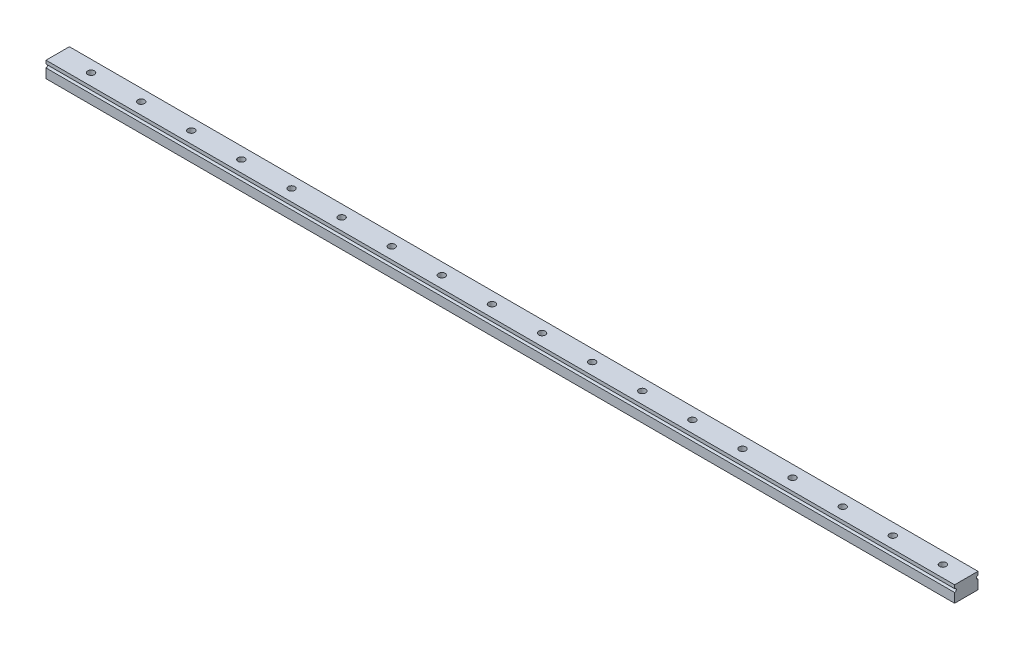
ISO-10303-21;
HEADER;
FILE_DESCRIPTION(('STEP AP214'),'2;1');
FILE_NAME('part.step','',(''),(''),'','','');
FILE_SCHEMA(('AUTOMOTIVE_DESIGN { 1 0 10303 214 1 1 1 1 }'));
ENDSEC;
DATA;
#1=APPLICATION_CONTEXT('core data for automotive mechanical design processes');
#2=APPLICATION_PROTOCOL_DEFINITION('international standard','automotive_design',2000,#1);
#3=PRODUCT_CONTEXT('',#1,'mechanical');
#4=PRODUCT('Part','Part','',(#3));
#5=PRODUCT_RELATED_PRODUCT_CATEGORY('part','',(#4));
#6=PRODUCT_DEFINITION_FORMATION('','',#4);
#7=PRODUCT_DEFINITION_CONTEXT('part definition',#1,'design');
#8=PRODUCT_DEFINITION('design','',#6,#7);
#9=PRODUCT_DEFINITION_SHAPE('','',#8);
#10=(LENGTH_UNIT() NAMED_UNIT(*) SI_UNIT(.MILLI.,.METRE.));
#11=(NAMED_UNIT(*) PLANE_ANGLE_UNIT() SI_UNIT($,.RADIAN.));
#12=(NAMED_UNIT(*) SI_UNIT($,.STERADIAN.) SOLID_ANGLE_UNIT());
#13=UNCERTAINTY_MEASURE_WITH_UNIT(LENGTH_MEASURE(1.E-05),#10,'distance_accuracy_value','');
#14=(GEOMETRIC_REPRESENTATION_CONTEXT(3) GLOBAL_UNCERTAINTY_ASSIGNED_CONTEXT((#13)) GLOBAL_UNIT_ASSIGNED_CONTEXT((#10,
#11,#12)) REPRESENTATION_CONTEXT('',''));
#15=CARTESIAN_POINT('',(0.,0.,0.));
#16=DIRECTION('',(0.,0.,1.));
#17=DIRECTION('',(1.,0.,0.));
#18=AXIS2_PLACEMENT_3D('',#15,#16,#17);
#19=CARTESIAN_POINT('',(272.,0.9,-3.5));
#20=DIRECTION('',(-1.,0.,0.));
#21=DIRECTION('',(0.,0.,1.));
#22=AXIS2_PLACEMENT_3D('',#19,#20,#21);
#23=CYLINDRICAL_SURFACE('',#22,0.500000000000001);
#24=CARTESIAN_POINT('',(0.,0.9,-3.5));
#25=DIRECTION('',(1.,0.,0.));
#26=DIRECTION('',(0.,0.,-1.));
#27=AXIS2_PLACEMENT_3D('',#24,#25,#26);
#28=CIRCLE('',#27,0.500000000000001);
#29=CARTESIAN_POINT('',(0.,1.4,-3.5));
#30=VERTEX_POINT('',#29);
#31=CARTESIAN_POINT('',(0.,0.399999999999999,-3.5));
#32=VERTEX_POINT('',#31);
#33=EDGE_CURVE('E135',#30,#32,#28,.T.);
#34=ORIENTED_EDGE('',*,*,#33,.F.);
#35=DIRECTION('',(-1.,0.,0.));
#36=VECTOR('',#35,1.);
#37=CARTESIAN_POINT('',(272.,1.4,-3.5));
#38=LINE('',#37,#36);
#39=CARTESIAN_POINT('',(272.,1.4,-3.5));
#40=VERTEX_POINT('',#39);
#41=EDGE_CURVE('E11',#40,#30,#38,.T.);
#42=ORIENTED_EDGE('',*,*,#41,.F.);
#43=CARTESIAN_POINT('',(272.,0.9,-3.5));
#44=DIRECTION('',(1.,0.,0.));
#45=DIRECTION('',(0.,0.,-1.));
#46=AXIS2_PLACEMENT_3D('',#43,#44,#45);
#47=CIRCLE('',#46,0.500000000000001);
#48=CARTESIAN_POINT('',(272.,0.399999999999999,-3.5));
#49=VERTEX_POINT('',#48);
#50=EDGE_CURVE('E179',#40,#49,#47,.T.);
#51=ORIENTED_EDGE('',*,*,#50,.T.);
#52=DIRECTION('',(-1.,0.,0.));
#53=VECTOR('',#52,1.);
#54=CARTESIAN_POINT('',(272.,0.399999999999999,-3.5));
#55=LINE('',#54,#53);
#56=EDGE_CURVE('E57',#49,#32,#55,.T.);
#57=ORIENTED_EDGE('',*,*,#56,.T.);
#58=EDGE_LOOP('',(#34,#42,#51,#57));
#59=FACE_BOUND('',#58,.T.);
#60=ADVANCED_FACE('F41',(#59),#23,.F.);
#61=CARTESIAN_POINT('',(272.,0.,-3.5));
#62=DIRECTION('',(0.,0.,-1.));
#63=DIRECTION('',(0.,1.,0.));
#64=AXIS2_PLACEMENT_3D('',#61,#62,#63);
#65=PLANE('',#64);
#66=DIRECTION('',(0.,-1.,0.));
#67=VECTOR('',#66,1.);
#68=CARTESIAN_POINT('',(0.,0.,-3.5));
#69=LINE('',#68,#67);
#70=CARTESIAN_POINT('',(0.,2.4,-3.5));
#71=VERTEX_POINT('',#70);
#72=EDGE_CURVE('E137',#71,#30,#69,.T.);
#73=ORIENTED_EDGE('',*,*,#72,.F.);
#74=DIRECTION('',(-1.,0.,0.));
#75=VECTOR('',#74,1.);
#76=CARTESIAN_POINT('',(272.,2.4,-3.5));
#77=LINE('',#76,#75);
#78=CARTESIAN_POINT('',(272.,2.4,-3.5));
#79=VERTEX_POINT('',#78);
#80=EDGE_CURVE('E49',#79,#71,#77,.T.);
#81=ORIENTED_EDGE('',*,*,#80,.F.);
#82=DIRECTION('',(0.,-1.,0.));
#83=VECTOR('',#82,1.);
#84=CARTESIAN_POINT('',(272.,0.,-3.5));
#85=LINE('',#84,#83);
#86=EDGE_CURVE('E132',#79,#40,#85,.T.);
#87=ORIENTED_EDGE('',*,*,#86,.T.);
#88=ORIENTED_EDGE('',*,*,#41,.T.);
#89=EDGE_LOOP('',(#73,#81,#87,#88));
#90=FACE_BOUND('',#89,.T.);
#91=ADVANCED_FACE('F169',(#90),#65,.T.);
#92=CARTESIAN_POINT('',(272.,2.4,0.));
#93=DIRECTION('',(0.,1.,0.));
#94=DIRECTION('',(0.,0.,1.));
#95=AXIS2_PLACEMENT_3D('',#92,#93,#94);
#96=PLANE('',#95);
#97=CARTESIAN_POINT('',(265.,2.4,0.));
#98=DIRECTION('',(0.,1.,0.));
#99=DIRECTION('',(0.,0.,1.));
#100=AXIS2_PLACEMENT_3D('',#97,#98,#99);
#101=CIRCLE('',#100,0.999999999999998);
#102=CARTESIAN_POINT('',(265.,2.4,0.999999999999998));
#103=VERTEX_POINT('',#102);
#104=EDGE_CURVE('E284',#103,#103,#101,.T.);
#105=ORIENTED_EDGE('',*,*,#104,.F.);
#106=EDGE_LOOP('',(#105));
#107=FACE_BOUND('',#106,.T.);
#108=CARTESIAN_POINT('',(250.,2.4,0.));
#109=DIRECTION('',(0.,1.,0.));
#110=DIRECTION('',(0.,0.,1.));
#111=AXIS2_PLACEMENT_3D('',#108,#109,#110);
#112=CIRCLE('',#111,0.999999999999998);
#113=CARTESIAN_POINT('',(250.,2.4,0.999999999999998));
#114=VERTEX_POINT('',#113);
#115=EDGE_CURVE('E278',#114,#114,#112,.T.);
#116=ORIENTED_EDGE('',*,*,#115,.F.);
#117=EDGE_LOOP('',(#116));
#118=FACE_BOUND('',#117,.T.);
#119=CARTESIAN_POINT('',(235.,2.4,0.));
#120=DIRECTION('',(0.,1.,0.));
#121=DIRECTION('',(0.,0.,1.));
#122=AXIS2_PLACEMENT_3D('',#119,#120,#121);
#123=CIRCLE('',#122,0.999999999999998);
#124=CARTESIAN_POINT('',(235.,2.4,0.999999999999998));
#125=VERTEX_POINT('',#124);
#126=EDGE_CURVE('E272',#125,#125,#123,.T.);
#127=ORIENTED_EDGE('',*,*,#126,.F.);
#128=EDGE_LOOP('',(#127));
#129=FACE_BOUND('',#128,.T.);
#130=CARTESIAN_POINT('',(220.,2.4,0.));
#131=DIRECTION('',(0.,1.,0.));
#132=DIRECTION('',(0.,0.,1.));
#133=AXIS2_PLACEMENT_3D('',#130,#131,#132);
#134=CIRCLE('',#133,0.999999999999998);
#135=CARTESIAN_POINT('',(220.,2.4,0.999999999999998));
#136=VERTEX_POINT('',#135);
#137=EDGE_CURVE('E266',#136,#136,#134,.T.);
#138=ORIENTED_EDGE('',*,*,#137,.F.);
#139=EDGE_LOOP('',(#138));
#140=FACE_BOUND('',#139,.T.);
#141=CARTESIAN_POINT('',(205.,2.4,0.));
#142=DIRECTION('',(0.,1.,0.));
#143=DIRECTION('',(0.,0.,1.));
#144=AXIS2_PLACEMENT_3D('',#141,#142,#143);
#145=CIRCLE('',#144,0.999999999999998);
#146=CARTESIAN_POINT('',(205.,2.4,0.999999999999998));
#147=VERTEX_POINT('',#146);
#148=EDGE_CURVE('E260',#147,#147,#145,.T.);
#149=ORIENTED_EDGE('',*,*,#148,.F.);
#150=EDGE_LOOP('',(#149));
#151=FACE_BOUND('',#150,.T.);
#152=CARTESIAN_POINT('',(190.,2.4,0.));
#153=DIRECTION('',(0.,1.,0.));
#154=DIRECTION('',(0.,0.,1.));
#155=AXIS2_PLACEMENT_3D('',#152,#153,#154);
#156=CIRCLE('',#155,0.999999999999998);
#157=CARTESIAN_POINT('',(190.,2.4,0.999999999999998));
#158=VERTEX_POINT('',#157);
#159=EDGE_CURVE('E254',#158,#158,#156,.T.);
#160=ORIENTED_EDGE('',*,*,#159,.F.);
#161=EDGE_LOOP('',(#160));
#162=FACE_BOUND('',#161,.T.);
#163=CARTESIAN_POINT('',(175.,2.4,0.));
#164=DIRECTION('',(0.,1.,0.));
#165=DIRECTION('',(0.,0.,1.));
#166=AXIS2_PLACEMENT_3D('',#163,#164,#165);
#167=CIRCLE('',#166,0.999999999999998);
#168=CARTESIAN_POINT('',(175.,2.4,0.999999999999998));
#169=VERTEX_POINT('',#168);
#170=EDGE_CURVE('E248',#169,#169,#167,.T.);
#171=ORIENTED_EDGE('',*,*,#170,.F.);
#172=EDGE_LOOP('',(#171));
#173=FACE_BOUND('',#172,.T.);
#174=CARTESIAN_POINT('',(160.,2.4,0.));
#175=DIRECTION('',(0.,1.,0.));
#176=DIRECTION('',(0.,0.,1.));
#177=AXIS2_PLACEMENT_3D('',#174,#175,#176);
#178=CIRCLE('',#177,0.999999999999998);
#179=CARTESIAN_POINT('',(160.,2.4,0.999999999999998));
#180=VERTEX_POINT('',#179);
#181=EDGE_CURVE('E242',#180,#180,#178,.T.);
#182=ORIENTED_EDGE('',*,*,#181,.F.);
#183=EDGE_LOOP('',(#182));
#184=FACE_BOUND('',#183,.T.);
#185=CARTESIAN_POINT('',(145.,2.4,0.));
#186=DIRECTION('',(0.,1.,0.));
#187=DIRECTION('',(0.,0.,1.));
#188=AXIS2_PLACEMENT_3D('',#185,#186,#187);
#189=CIRCLE('',#188,0.999999999999998);
#190=CARTESIAN_POINT('',(145.,2.4,0.999999999999998));
#191=VERTEX_POINT('',#190);
#192=EDGE_CURVE('E236',#191,#191,#189,.T.);
#193=ORIENTED_EDGE('',*,*,#192,.F.);
#194=EDGE_LOOP('',(#193));
#195=FACE_BOUND('',#194,.T.);
#196=CARTESIAN_POINT('',(130.,2.4,0.));
#197=DIRECTION('',(0.,1.,0.));
#198=DIRECTION('',(0.,0.,1.));
#199=AXIS2_PLACEMENT_3D('',#196,#197,#198);
#200=CIRCLE('',#199,0.999999999999998);
#201=CARTESIAN_POINT('',(130.,2.4,0.999999999999998));
#202=VERTEX_POINT('',#201);
#203=EDGE_CURVE('E230',#202,#202,#200,.T.);
#204=ORIENTED_EDGE('',*,*,#203,.F.);
#205=EDGE_LOOP('',(#204));
#206=FACE_BOUND('',#205,.T.);
#207=CARTESIAN_POINT('',(115.,2.4,0.));
#208=DIRECTION('',(0.,1.,0.));
#209=DIRECTION('',(0.,0.,1.));
#210=AXIS2_PLACEMENT_3D('',#207,#208,#209);
#211=CIRCLE('',#210,0.999999999999998);
#212=CARTESIAN_POINT('',(115.,2.4,0.999999999999998));
#213=VERTEX_POINT('',#212);
#214=EDGE_CURVE('E224',#213,#213,#211,.T.);
#215=ORIENTED_EDGE('',*,*,#214,.F.);
#216=EDGE_LOOP('',(#215));
#217=FACE_BOUND('',#216,.T.);
#218=CARTESIAN_POINT('',(100.,2.4,0.));
#219=DIRECTION('',(0.,1.,0.));
#220=DIRECTION('',(0.,0.,1.));
#221=AXIS2_PLACEMENT_3D('',#218,#219,#220);
#222=CIRCLE('',#221,0.999999999999998);
#223=CARTESIAN_POINT('',(100.,2.4,0.999999999999998));
#224=VERTEX_POINT('',#223);
#225=EDGE_CURVE('E218',#224,#224,#222,.T.);
#226=ORIENTED_EDGE('',*,*,#225,.F.);
#227=EDGE_LOOP('',(#226));
#228=FACE_BOUND('',#227,.T.);
#229=CARTESIAN_POINT('',(85.,2.4,0.));
#230=DIRECTION('',(0.,1.,0.));
#231=DIRECTION('',(0.,0.,1.));
#232=AXIS2_PLACEMENT_3D('',#229,#230,#231);
#233=CIRCLE('',#232,0.999999999999998);
#234=CARTESIAN_POINT('',(85.,2.4,0.999999999999998));
#235=VERTEX_POINT('',#234);
#236=EDGE_CURVE('E212',#235,#235,#233,.T.);
#237=ORIENTED_EDGE('',*,*,#236,.F.);
#238=EDGE_LOOP('',(#237));
#239=FACE_BOUND('',#238,.T.);
#240=CARTESIAN_POINT('',(70.,2.4,0.));
#241=DIRECTION('',(0.,1.,0.));
#242=DIRECTION('',(0.,0.,1.));
#243=AXIS2_PLACEMENT_3D('',#240,#241,#242);
#244=CIRCLE('',#243,0.999999999999998);
#245=CARTESIAN_POINT('',(70.,2.4,0.999999999999998));
#246=VERTEX_POINT('',#245);
#247=EDGE_CURVE('E206',#246,#246,#244,.T.);
#248=ORIENTED_EDGE('',*,*,#247,.F.);
#249=EDGE_LOOP('',(#248));
#250=FACE_BOUND('',#249,.T.);
#251=CARTESIAN_POINT('',(55.,2.4,0.));
#252=DIRECTION('',(0.,1.,0.));
#253=DIRECTION('',(0.,0.,1.));
#254=AXIS2_PLACEMENT_3D('',#251,#252,#253);
#255=CIRCLE('',#254,0.999999999999998);
#256=CARTESIAN_POINT('',(55.,2.4,0.999999999999998));
#257=VERTEX_POINT('',#256);
#258=EDGE_CURVE('E200',#257,#257,#255,.T.);
#259=ORIENTED_EDGE('',*,*,#258,.F.);
#260=EDGE_LOOP('',(#259));
#261=FACE_BOUND('',#260,.T.);
#262=CARTESIAN_POINT('',(40.,2.4,0.));
#263=DIRECTION('',(0.,1.,0.));
#264=DIRECTION('',(0.,0.,1.));
#265=AXIS2_PLACEMENT_3D('',#262,#263,#264);
#266=CIRCLE('',#265,0.999999999999998);
#267=CARTESIAN_POINT('',(40.,2.4,0.999999999999998));
#268=VERTEX_POINT('',#267);
#269=EDGE_CURVE('E194',#268,#268,#266,.T.);
#270=ORIENTED_EDGE('',*,*,#269,.F.);
#271=EDGE_LOOP('',(#270));
#272=FACE_BOUND('',#271,.T.);
#273=CARTESIAN_POINT('',(25.,2.4,0.));
#274=DIRECTION('',(0.,1.,0.));
#275=DIRECTION('',(0.,0.,1.));
#276=AXIS2_PLACEMENT_3D('',#273,#274,#275);
#277=CIRCLE('',#276,1.);
#278=CARTESIAN_POINT('',(25.,2.4,1.));
#279=VERTEX_POINT('',#278);
#280=EDGE_CURVE('E188',#279,#279,#277,.T.);
#281=ORIENTED_EDGE('',*,*,#280,.F.);
#282=EDGE_LOOP('',(#281));
#283=FACE_BOUND('',#282,.T.);
#284=CARTESIAN_POINT('',(10.,2.4,0.));
#285=DIRECTION('',(0.,1.,0.));
#286=DIRECTION('',(0.,0.,1.));
#287=AXIS2_PLACEMENT_3D('',#284,#285,#286);
#288=CIRCLE('',#287,1.);
#289=CARTESIAN_POINT('',(10.,2.4,1.));
#290=VERTEX_POINT('',#289);
#291=EDGE_CURVE('E182',#290,#290,#288,.T.);
#292=ORIENTED_EDGE('',*,*,#291,.F.);
#293=EDGE_LOOP('',(#292));
#294=FACE_BOUND('',#293,.T.);
#295=DIRECTION('',(0.,0.,-1.));
#296=VECTOR('',#295,1.);
#297=CARTESIAN_POINT('',(0.,2.4,0.));
#298=LINE('',#297,#296);
#299=CARTESIAN_POINT('',(0.,2.4,3.5));
#300=VERTEX_POINT('',#299);
#301=EDGE_CURVE('E141',#300,#71,#298,.T.);
#302=ORIENTED_EDGE('',*,*,#301,.F.);
#303=DIRECTION('',(-1.,0.,0.));
#304=VECTOR('',#303,1.);
#305=CARTESIAN_POINT('',(272.,2.4,3.5));
#306=LINE('',#305,#304);
#307=CARTESIAN_POINT('',(272.,2.4,3.5));
#308=VERTEX_POINT('',#307);
#309=EDGE_CURVE('E158',#308,#300,#306,.T.);
#310=ORIENTED_EDGE('',*,*,#309,.F.);
#311=DIRECTION('',(0.,0.,-1.));
#312=VECTOR('',#311,1.);
#313=CARTESIAN_POINT('',(272.,2.4,0.));
#314=LINE('',#313,#312);
#315=EDGE_CURVE('E165',#308,#79,#314,.T.);
#316=ORIENTED_EDGE('',*,*,#315,.T.);
#317=ORIENTED_EDGE('',*,*,#80,.T.);
#318=EDGE_LOOP('',(#302,#310,#316,#317));
#319=FACE_BOUND('',#318,.T.);
#320=ADVANCED_FACE('F163',(#107,#118,#129,#140,#151,#162,#173,#184,#195,#206,#217,#228,#239,
#250,#261,#272,#283,#294,#319),#96,.T.);
#321=CARTESIAN_POINT('',(272.,0.,3.5));
#322=DIRECTION('',(0.,0.,-1.));
#323=DIRECTION('',(0.,1.,0.));
#324=AXIS2_PLACEMENT_3D('',#321,#322,#323);
#325=PLANE('',#324);
#326=DIRECTION('',(0.,-1.,0.));
#327=VECTOR('',#326,1.);
#328=CARTESIAN_POINT('',(0.,0.,3.5));
#329=LINE('',#328,#327);
#330=CARTESIAN_POINT('',(0.,1.4,3.5));
#331=VERTEX_POINT('',#330);
#332=EDGE_CURVE('E145',#300,#331,#329,.T.);
#333=ORIENTED_EDGE('',*,*,#332,.T.);
#334=DIRECTION('',(-1.,0.,0.));
#335=VECTOR('',#334,1.);
#336=CARTESIAN_POINT('',(272.,1.4,3.5));
#337=LINE('',#336,#335);
#338=CARTESIAN_POINT('',(272.,1.4,3.5));
#339=VERTEX_POINT('',#338);
#340=EDGE_CURVE('E156',#339,#331,#337,.T.);
#341=ORIENTED_EDGE('',*,*,#340,.F.);
#342=DIRECTION('',(0.,-1.,0.));
#343=VECTOR('',#342,1.);
#344=CARTESIAN_POINT('',(272.,0.,3.5));
#345=LINE('',#344,#343);
#346=EDGE_CURVE('E118',#308,#339,#345,.T.);
#347=ORIENTED_EDGE('',*,*,#346,.F.);
#348=ORIENTED_EDGE('',*,*,#309,.T.);
#349=EDGE_LOOP('',(#333,#341,#347,#348));
#350=FACE_BOUND('',#349,.T.);
#351=ADVANCED_FACE('F176',(#350),#325,.F.);
#352=CARTESIAN_POINT('',(272.,0.9,3.5));
#353=DIRECTION('',(-1.,0.,0.));
#354=DIRECTION('',(0.,0.,1.));
#355=AXIS2_PLACEMENT_3D('',#352,#353,#354);
#356=CYLINDRICAL_SURFACE('',#355,0.500000000000001);
#357=CARTESIAN_POINT('',(0.,0.9,3.5));
#358=DIRECTION('',(1.,0.,0.));
#359=DIRECTION('',(0.,0.,-1.));
#360=AXIS2_PLACEMENT_3D('',#357,#358,#359);
#361=CIRCLE('',#360,0.500000000000001);
#362=CARTESIAN_POINT('',(0.,0.399999999999999,3.5));
#363=VERTEX_POINT('',#362);
#364=EDGE_CURVE('E148',#363,#331,#361,.T.);
#365=ORIENTED_EDGE('',*,*,#364,.F.);
#366=DIRECTION('',(-1.,0.,0.));
#367=VECTOR('',#366,1.);
#368=CARTESIAN_POINT('',(272.,0.399999999999999,3.5));
#369=LINE('',#368,#367);
#370=CARTESIAN_POINT('',(272.,0.399999999999999,3.5));
#371=VERTEX_POINT('',#370);
#372=EDGE_CURVE('E126',#371,#363,#369,.T.);
#373=ORIENTED_EDGE('',*,*,#372,.F.);
#374=CARTESIAN_POINT('',(272.,0.9,3.5));
#375=DIRECTION('',(1.,0.,0.));
#376=DIRECTION('',(0.,0.,-1.));
#377=AXIS2_PLACEMENT_3D('',#374,#375,#376);
#378=CIRCLE('',#377,0.500000000000001);
#379=EDGE_CURVE('E115',#371,#339,#378,.T.);
#380=ORIENTED_EDGE('',*,*,#379,.T.);
#381=ORIENTED_EDGE('',*,*,#340,.T.);
#382=EDGE_LOOP('',(#365,#373,#380,#381));
#383=FACE_BOUND('',#382,.T.);
#384=ADVANCED_FACE('F366',(#383),#356,.F.);
#385=CARTESIAN_POINT('',(0.,-2.4,3.5));
#386=VERTEX_POINT('',#385);
#387=EDGE_CURVE('E123',#363,#386,#329,.T.);
#388=ORIENTED_EDGE('',*,*,#387,.T.);
#389=DIRECTION('',(-1.,0.,0.));
#390=VECTOR('',#389,1.);
#391=CARTESIAN_POINT('',(272.,-2.4,3.5));
#392=LINE('',#391,#390);
#393=CARTESIAN_POINT('',(272.,-2.4,3.5));
#394=VERTEX_POINT('',#393);
#395=EDGE_CURVE('E120',#394,#386,#392,.T.);
#396=ORIENTED_EDGE('',*,*,#395,.F.);
#397=EDGE_CURVE('E108',#371,#394,#345,.T.);
#398=ORIENTED_EDGE('',*,*,#397,.F.);
#399=ORIENTED_EDGE('',*,*,#372,.T.);
#400=EDGE_LOOP('',(#388,#396,#398,#399));
#401=FACE_BOUND('',#400,.T.);
#402=ADVANCED_FACE('F121',(#401),#325,.F.);
#403=CARTESIAN_POINT('',(272.,-2.4,0.));
#404=DIRECTION('',(0.,1.,0.));
#405=DIRECTION('',(0.,0.,1.));
#406=AXIS2_PLACEMENT_3D('',#403,#404,#405);
#407=PLANE('',#406);
#408=CARTESIAN_POINT('',(265.,-2.4,0.));
#409=DIRECTION('',(0.,1.,0.));
#410=DIRECTION('',(0.,0.,1.));
#411=AXIS2_PLACEMENT_3D('',#408,#409,#410);
#412=CIRCLE('',#411,0.999999999999998);
#413=CARTESIAN_POINT('',(265.,-2.4,0.999999999999998));
#414=VERTEX_POINT('',#413);
#415=EDGE_CURVE('E281',#414,#414,#412,.T.);
#416=ORIENTED_EDGE('',*,*,#415,.T.);
#417=EDGE_LOOP('',(#416));
#418=FACE_BOUND('',#417,.T.);
#419=CARTESIAN_POINT('',(250.,-2.4,0.));
#420=DIRECTION('',(0.,1.,0.));
#421=DIRECTION('',(0.,0.,1.));
#422=AXIS2_PLACEMENT_3D('',#419,#420,#421);
#423=CIRCLE('',#422,0.999999999999998);
#424=CARTESIAN_POINT('',(250.,-2.4,0.999999999999998));
#425=VERTEX_POINT('',#424);
#426=EDGE_CURVE('E275',#425,#425,#423,.T.);
#427=ORIENTED_EDGE('',*,*,#426,.T.);
#428=EDGE_LOOP('',(#427));
#429=FACE_BOUND('',#428,.T.);
#430=CARTESIAN_POINT('',(235.,-2.4,0.));
#431=DIRECTION('',(0.,1.,0.));
#432=DIRECTION('',(0.,0.,1.));
#433=AXIS2_PLACEMENT_3D('',#430,#431,#432);
#434=CIRCLE('',#433,0.999999999999998);
#435=CARTESIAN_POINT('',(235.,-2.4,0.999999999999998));
#436=VERTEX_POINT('',#435);
#437=EDGE_CURVE('E269',#436,#436,#434,.T.);
#438=ORIENTED_EDGE('',*,*,#437,.T.);
#439=EDGE_LOOP('',(#438));
#440=FACE_BOUND('',#439,.T.);
#441=CARTESIAN_POINT('',(220.,-2.4,0.));
#442=DIRECTION('',(0.,1.,0.));
#443=DIRECTION('',(0.,0.,1.));
#444=AXIS2_PLACEMENT_3D('',#441,#442,#443);
#445=CIRCLE('',#444,0.999999999999998);
#446=CARTESIAN_POINT('',(220.,-2.4,0.999999999999998));
#447=VERTEX_POINT('',#446);
#448=EDGE_CURVE('E263',#447,#447,#445,.T.);
#449=ORIENTED_EDGE('',*,*,#448,.T.);
#450=EDGE_LOOP('',(#449));
#451=FACE_BOUND('',#450,.T.);
#452=CARTESIAN_POINT('',(205.,-2.4,0.));
#453=DIRECTION('',(0.,1.,0.));
#454=DIRECTION('',(0.,0.,1.));
#455=AXIS2_PLACEMENT_3D('',#452,#453,#454);
#456=CIRCLE('',#455,0.999999999999998);
#457=CARTESIAN_POINT('',(205.,-2.4,0.999999999999998));
#458=VERTEX_POINT('',#457);
#459=EDGE_CURVE('E257',#458,#458,#456,.T.);
#460=ORIENTED_EDGE('',*,*,#459,.T.);
#461=EDGE_LOOP('',(#460));
#462=FACE_BOUND('',#461,.T.);
#463=CARTESIAN_POINT('',(190.,-2.4,0.));
#464=DIRECTION('',(0.,1.,0.));
#465=DIRECTION('',(0.,0.,1.));
#466=AXIS2_PLACEMENT_3D('',#463,#464,#465);
#467=CIRCLE('',#466,0.999999999999998);
#468=CARTESIAN_POINT('',(190.,-2.4,0.999999999999998));
#469=VERTEX_POINT('',#468);
#470=EDGE_CURVE('E251',#469,#469,#467,.T.);
#471=ORIENTED_EDGE('',*,*,#470,.T.);
#472=EDGE_LOOP('',(#471));
#473=FACE_BOUND('',#472,.T.);
#474=CARTESIAN_POINT('',(175.,-2.4,0.));
#475=DIRECTION('',(0.,1.,0.));
#476=DIRECTION('',(0.,0.,1.));
#477=AXIS2_PLACEMENT_3D('',#474,#475,#476);
#478=CIRCLE('',#477,0.999999999999998);
#479=CARTESIAN_POINT('',(175.,-2.4,0.999999999999998));
#480=VERTEX_POINT('',#479);
#481=EDGE_CURVE('E245',#480,#480,#478,.T.);
#482=ORIENTED_EDGE('',*,*,#481,.T.);
#483=EDGE_LOOP('',(#482));
#484=FACE_BOUND('',#483,.T.);
#485=CARTESIAN_POINT('',(160.,-2.4,0.));
#486=DIRECTION('',(0.,1.,0.));
#487=DIRECTION('',(0.,0.,1.));
#488=AXIS2_PLACEMENT_3D('',#485,#486,#487);
#489=CIRCLE('',#488,0.999999999999998);
#490=CARTESIAN_POINT('',(160.,-2.4,0.999999999999998));
#491=VERTEX_POINT('',#490);
#492=EDGE_CURVE('E239',#491,#491,#489,.T.);
#493=ORIENTED_EDGE('',*,*,#492,.T.);
#494=EDGE_LOOP('',(#493));
#495=FACE_BOUND('',#494,.T.);
#496=CARTESIAN_POINT('',(145.,-2.4,0.));
#497=DIRECTION('',(0.,1.,0.));
#498=DIRECTION('',(0.,0.,1.));
#499=AXIS2_PLACEMENT_3D('',#496,#497,#498);
#500=CIRCLE('',#499,0.999999999999998);
#501=CARTESIAN_POINT('',(145.,-2.4,0.999999999999998));
#502=VERTEX_POINT('',#501);
#503=EDGE_CURVE('E233',#502,#502,#500,.T.);
#504=ORIENTED_EDGE('',*,*,#503,.T.);
#505=EDGE_LOOP('',(#504));
#506=FACE_BOUND('',#505,.T.);
#507=CARTESIAN_POINT('',(130.,-2.4,0.));
#508=DIRECTION('',(0.,1.,0.));
#509=DIRECTION('',(0.,0.,1.));
#510=AXIS2_PLACEMENT_3D('',#507,#508,#509);
#511=CIRCLE('',#510,0.999999999999998);
#512=CARTESIAN_POINT('',(130.,-2.4,0.999999999999998));
#513=VERTEX_POINT('',#512);
#514=EDGE_CURVE('E227',#513,#513,#511,.T.);
#515=ORIENTED_EDGE('',*,*,#514,.T.);
#516=EDGE_LOOP('',(#515));
#517=FACE_BOUND('',#516,.T.);
#518=CARTESIAN_POINT('',(115.,-2.4,0.));
#519=DIRECTION('',(0.,1.,0.));
#520=DIRECTION('',(0.,0.,1.));
#521=AXIS2_PLACEMENT_3D('',#518,#519,#520);
#522=CIRCLE('',#521,0.999999999999998);
#523=CARTESIAN_POINT('',(115.,-2.4,0.999999999999998));
#524=VERTEX_POINT('',#523);
#525=EDGE_CURVE('E221',#524,#524,#522,.T.);
#526=ORIENTED_EDGE('',*,*,#525,.T.);
#527=EDGE_LOOP('',(#526));
#528=FACE_BOUND('',#527,.T.);
#529=CARTESIAN_POINT('',(100.,-2.4,0.));
#530=DIRECTION('',(0.,1.,0.));
#531=DIRECTION('',(0.,0.,1.));
#532=AXIS2_PLACEMENT_3D('',#529,#530,#531);
#533=CIRCLE('',#532,0.999999999999998);
#534=CARTESIAN_POINT('',(100.,-2.4,0.999999999999998));
#535=VERTEX_POINT('',#534);
#536=EDGE_CURVE('E215',#535,#535,#533,.T.);
#537=ORIENTED_EDGE('',*,*,#536,.T.);
#538=EDGE_LOOP('',(#537));
#539=FACE_BOUND('',#538,.T.);
#540=CARTESIAN_POINT('',(85.,-2.4,0.));
#541=DIRECTION('',(0.,1.,0.));
#542=DIRECTION('',(0.,0.,1.));
#543=AXIS2_PLACEMENT_3D('',#540,#541,#542);
#544=CIRCLE('',#543,0.999999999999998);
#545=CARTESIAN_POINT('',(85.,-2.4,0.999999999999998));
#546=VERTEX_POINT('',#545);
#547=EDGE_CURVE('E209',#546,#546,#544,.T.);
#548=ORIENTED_EDGE('',*,*,#547,.T.);
#549=EDGE_LOOP('',(#548));
#550=FACE_BOUND('',#549,.T.);
#551=CARTESIAN_POINT('',(70.,-2.4,0.));
#552=DIRECTION('',(0.,1.,0.));
#553=DIRECTION('',(0.,0.,1.));
#554=AXIS2_PLACEMENT_3D('',#551,#552,#553);
#555=CIRCLE('',#554,0.999999999999998);
#556=CARTESIAN_POINT('',(70.,-2.4,0.999999999999998));
#557=VERTEX_POINT('',#556);
#558=EDGE_CURVE('E203',#557,#557,#555,.T.);
#559=ORIENTED_EDGE('',*,*,#558,.T.);
#560=EDGE_LOOP('',(#559));
#561=FACE_BOUND('',#560,.T.);
#562=CARTESIAN_POINT('',(55.,-2.4,0.));
#563=DIRECTION('',(0.,1.,0.));
#564=DIRECTION('',(0.,0.,1.));
#565=AXIS2_PLACEMENT_3D('',#562,#563,#564);
#566=CIRCLE('',#565,0.999999999999998);
#567=CARTESIAN_POINT('',(55.,-2.4,0.999999999999998));
#568=VERTEX_POINT('',#567);
#569=EDGE_CURVE('E197',#568,#568,#566,.T.);
#570=ORIENTED_EDGE('',*,*,#569,.T.);
#571=EDGE_LOOP('',(#570));
#572=FACE_BOUND('',#571,.T.);
#573=CARTESIAN_POINT('',(40.,-2.4,0.));
#574=DIRECTION('',(0.,1.,0.));
#575=DIRECTION('',(0.,0.,1.));
#576=AXIS2_PLACEMENT_3D('',#573,#574,#575);
#577=CIRCLE('',#576,0.999999999999998);
#578=CARTESIAN_POINT('',(40.,-2.4,0.999999999999998));
#579=VERTEX_POINT('',#578);
#580=EDGE_CURVE('E191',#579,#579,#577,.T.);
#581=ORIENTED_EDGE('',*,*,#580,.T.);
#582=EDGE_LOOP('',(#581));
#583=FACE_BOUND('',#582,.T.);
#584=CARTESIAN_POINT('',(25.,-2.4,0.));
#585=DIRECTION('',(0.,1.,0.));
#586=DIRECTION('',(0.,0.,1.));
#587=AXIS2_PLACEMENT_3D('',#584,#585,#586);
#588=CIRCLE('',#587,1.);
#589=CARTESIAN_POINT('',(25.,-2.4,1.));
#590=VERTEX_POINT('',#589);
#591=EDGE_CURVE('E185',#590,#590,#588,.T.);
#592=ORIENTED_EDGE('',*,*,#591,.T.);
#593=EDGE_LOOP('',(#592));
#594=FACE_BOUND('',#593,.T.);
#595=CARTESIAN_POINT('',(10.,-2.4,0.));
#596=DIRECTION('',(0.,1.,0.));
#597=DIRECTION('',(0.,0.,1.));
#598=AXIS2_PLACEMENT_3D('',#595,#596,#597);
#599=CIRCLE('',#598,1.);
#600=CARTESIAN_POINT('',(10.,-2.4,1.));
#601=VERTEX_POINT('',#600);
#602=EDGE_CURVE('E138',#601,#601,#599,.T.);
#603=ORIENTED_EDGE('',*,*,#602,.T.);
#604=EDGE_LOOP('',(#603));
#605=FACE_BOUND('',#604,.T.);
#606=DIRECTION('',(0.,0.,-1.));
#607=VECTOR('',#606,1.);
#608=CARTESIAN_POINT('',(0.,-2.4,0.));
#609=LINE('',#608,#607);
#610=CARTESIAN_POINT('',(0.,-2.4,-3.5));
#611=VERTEX_POINT('',#610);
#612=EDGE_CURVE('E151',#386,#611,#609,.T.);
#613=ORIENTED_EDGE('',*,*,#612,.T.);
#614=DIRECTION('',(-1.,0.,0.));
#615=VECTOR('',#614,1.);
#616=CARTESIAN_POINT('',(272.,-2.4,-3.5));
#617=LINE('',#616,#615);
#618=CARTESIAN_POINT('',(272.,-2.4,-3.5));
#619=VERTEX_POINT('',#618);
#620=EDGE_CURVE('E83',#619,#611,#617,.T.);
#621=ORIENTED_EDGE('',*,*,#620,.F.);
#622=DIRECTION('',(0.,0.,-1.));
#623=VECTOR('',#622,1.);
#624=CARTESIAN_POINT('',(272.,-2.4,0.));
#625=LINE('',#624,#623);
#626=EDGE_CURVE('E113',#394,#619,#625,.T.);
#627=ORIENTED_EDGE('',*,*,#626,.F.);
#628=ORIENTED_EDGE('',*,*,#395,.T.);
#629=EDGE_LOOP('',(#613,#621,#627,#628));
#630=FACE_BOUND('',#629,.T.);
#631=ADVANCED_FACE('F128',(#418,#429,#440,#451,#462,#473,#484,#495,#506,#517,#528,#539,#550,
#561,#572,#583,#594,#605,#630),#407,.F.);
#632=EDGE_CURVE('E142',#32,#611,#69,.T.);
#633=ORIENTED_EDGE('',*,*,#632,.F.);
#634=ORIENTED_EDGE('',*,*,#56,.F.);
#635=EDGE_CURVE('E129',#49,#619,#85,.T.);
#636=ORIENTED_EDGE('',*,*,#635,.T.);
#637=ORIENTED_EDGE('',*,*,#620,.T.);
#638=EDGE_LOOP('',(#633,#634,#636,#637));
#639=FACE_BOUND('',#638,.T.);
#640=ADVANCED_FACE('F356',(#639),#65,.T.);
#641=CARTESIAN_POINT('',(272.,0.,0.));
#642=DIRECTION('',(1.,0.,0.));
#643=DIRECTION('',(0.,0.,-1.));
#644=AXIS2_PLACEMENT_3D('',#641,#642,#643);
#645=PLANE('',#644);
#646=ORIENTED_EDGE('',*,*,#50,.F.);
#647=ORIENTED_EDGE('',*,*,#86,.F.);
#648=ORIENTED_EDGE('',*,*,#315,.F.);
#649=ORIENTED_EDGE('',*,*,#346,.T.);
#650=ORIENTED_EDGE('',*,*,#379,.F.);
#651=ORIENTED_EDGE('',*,*,#397,.T.);
#652=ORIENTED_EDGE('',*,*,#626,.T.);
#653=ORIENTED_EDGE('',*,*,#635,.F.);
#654=EDGE_LOOP('',(#646,#647,#648,#649,#650,#651,#652,#653));
#655=FACE_BOUND('',#654,.T.);
#656=ADVANCED_FACE('F110',(#655),#645,.T.);
#657=CARTESIAN_POINT('',(0.,0.,0.));
#658=DIRECTION('',(1.,0.,0.));
#659=DIRECTION('',(0.,0.,-1.));
#660=AXIS2_PLACEMENT_3D('',#657,#658,#659);
#661=PLANE('',#660);
#662=ORIENTED_EDGE('',*,*,#33,.T.);
#663=ORIENTED_EDGE('',*,*,#632,.T.);
#664=ORIENTED_EDGE('',*,*,#612,.F.);
#665=ORIENTED_EDGE('',*,*,#387,.F.);
#666=ORIENTED_EDGE('',*,*,#364,.T.);
#667=ORIENTED_EDGE('',*,*,#332,.F.);
#668=ORIENTED_EDGE('',*,*,#301,.T.);
#669=ORIENTED_EDGE('',*,*,#72,.T.);
#670=EDGE_LOOP('',(#662,#663,#664,#665,#666,#667,#668,#669));
#671=FACE_BOUND('',#670,.T.);
#672=ADVANCED_FACE('F172',(#671),#661,.F.);
#673=CARTESIAN_POINT('',(10.,-2.4,0.));
#674=DIRECTION('',(0.,1.,0.));
#675=DIRECTION('',(0.,0.,1.));
#676=AXIS2_PLACEMENT_3D('',#673,#674,#675);
#677=CYLINDRICAL_SURFACE('',#676,1.);
#678=ORIENTED_EDGE('',*,*,#602,.F.);
#679=EDGE_LOOP('',(#678));
#680=FACE_BOUND('',#679,.T.);
#681=ORIENTED_EDGE('',*,*,#291,.T.);
#682=EDGE_LOOP('',(#681));
#683=FACE_BOUND('',#682,.T.);
#684=ADVANCED_FACE('F335',(#680,#683),#677,.F.);
#685=CARTESIAN_POINT('',(25.,-2.4,0.));
#686=DIRECTION('',(0.,1.,0.));
#687=DIRECTION('',(0.,0.,1.));
#688=AXIS2_PLACEMENT_3D('',#685,#686,#687);
#689=CYLINDRICAL_SURFACE('',#688,1.);
#690=ORIENTED_EDGE('',*,*,#591,.F.);
#691=EDGE_LOOP('',(#690));
#692=FACE_BOUND('',#691,.T.);
#693=ORIENTED_EDGE('',*,*,#280,.T.);
#694=EDGE_LOOP('',(#693));
#695=FACE_BOUND('',#694,.T.);
#696=ADVANCED_FACE('F337',(#692,#695),#689,.F.);
#697=CARTESIAN_POINT('',(40.,-2.4,0.));
#698=DIRECTION('',(0.,1.,0.));
#699=DIRECTION('',(0.,0.,1.));
#700=AXIS2_PLACEMENT_3D('',#697,#698,#699);
#701=CYLINDRICAL_SURFACE('',#700,0.999999999999998);
#702=ORIENTED_EDGE('',*,*,#580,.F.);
#703=EDGE_LOOP('',(#702));
#704=FACE_BOUND('',#703,.T.);
#705=ORIENTED_EDGE('',*,*,#269,.T.);
#706=EDGE_LOOP('',(#705));
#707=FACE_BOUND('',#706,.T.);
#708=ADVANCED_FACE('F344',(#704,#707),#701,.F.);
#709=CARTESIAN_POINT('',(55.,-2.4,0.));
#710=DIRECTION('',(0.,1.,0.));
#711=DIRECTION('',(0.,0.,1.));
#712=AXIS2_PLACEMENT_3D('',#709,#710,#711);
#713=CYLINDRICAL_SURFACE('',#712,0.999999999999998);
#714=ORIENTED_EDGE('',*,*,#569,.F.);
#715=EDGE_LOOP('',(#714));
#716=FACE_BOUND('',#715,.T.);
#717=ORIENTED_EDGE('',*,*,#258,.T.);
#718=EDGE_LOOP('',(#717));
#719=FACE_BOUND('',#718,.T.);
#720=ADVANCED_FACE('F434',(#716,#719),#713,.F.);
#721=CARTESIAN_POINT('',(70.,-2.4,0.));
#722=DIRECTION('',(0.,1.,0.));
#723=DIRECTION('',(0.,0.,1.));
#724=AXIS2_PLACEMENT_3D('',#721,#722,#723);
#725=CYLINDRICAL_SURFACE('',#724,0.999999999999998);
#726=ORIENTED_EDGE('',*,*,#558,.F.);
#727=EDGE_LOOP('',(#726));
#728=FACE_BOUND('',#727,.T.);
#729=ORIENTED_EDGE('',*,*,#247,.T.);
#730=EDGE_LOOP('',(#729));
#731=FACE_BOUND('',#730,.T.);
#732=ADVANCED_FACE('F444',(#728,#731),#725,.F.);
#733=CARTESIAN_POINT('',(85.,-2.4,0.));
#734=DIRECTION('',(0.,1.,0.));
#735=DIRECTION('',(0.,0.,1.));
#736=AXIS2_PLACEMENT_3D('',#733,#734,#735);
#737=CYLINDRICAL_SURFACE('',#736,0.999999999999998);
#738=ORIENTED_EDGE('',*,*,#547,.F.);
#739=EDGE_LOOP('',(#738));
#740=FACE_BOUND('',#739,.T.);
#741=ORIENTED_EDGE('',*,*,#236,.T.);
#742=EDGE_LOOP('',(#741));
#743=FACE_BOUND('',#742,.T.);
#744=ADVANCED_FACE('F454',(#740,#743),#737,.F.);
#745=CARTESIAN_POINT('',(100.,-2.4,0.));
#746=DIRECTION('',(0.,1.,0.));
#747=DIRECTION('',(0.,0.,1.));
#748=AXIS2_PLACEMENT_3D('',#745,#746,#747);
#749=CYLINDRICAL_SURFACE('',#748,0.999999999999998);
#750=ORIENTED_EDGE('',*,*,#536,.F.);
#751=EDGE_LOOP('',(#750));
#752=FACE_BOUND('',#751,.T.);
#753=ORIENTED_EDGE('',*,*,#225,.T.);
#754=EDGE_LOOP('',(#753));
#755=FACE_BOUND('',#754,.T.);
#756=ADVANCED_FACE('F464',(#752,#755),#749,.F.);
#757=CARTESIAN_POINT('',(115.,-2.4,0.));
#758=DIRECTION('',(0.,1.,0.));
#759=DIRECTION('',(0.,0.,1.));
#760=AXIS2_PLACEMENT_3D('',#757,#758,#759);
#761=CYLINDRICAL_SURFACE('',#760,0.999999999999998);
#762=ORIENTED_EDGE('',*,*,#525,.F.);
#763=EDGE_LOOP('',(#762));
#764=FACE_BOUND('',#763,.T.);
#765=ORIENTED_EDGE('',*,*,#214,.T.);
#766=EDGE_LOOP('',(#765));
#767=FACE_BOUND('',#766,.T.);
#768=ADVANCED_FACE('F474',(#764,#767),#761,.F.);
#769=CARTESIAN_POINT('',(130.,-2.4,0.));
#770=DIRECTION('',(0.,1.,0.));
#771=DIRECTION('',(0.,0.,1.));
#772=AXIS2_PLACEMENT_3D('',#769,#770,#771);
#773=CYLINDRICAL_SURFACE('',#772,0.999999999999998);
#774=ORIENTED_EDGE('',*,*,#514,.F.);
#775=EDGE_LOOP('',(#774));
#776=FACE_BOUND('',#775,.T.);
#777=ORIENTED_EDGE('',*,*,#203,.T.);
#778=EDGE_LOOP('',(#777));
#779=FACE_BOUND('',#778,.T.);
#780=ADVANCED_FACE('F484',(#776,#779),#773,.F.);
#781=CARTESIAN_POINT('',(145.,-2.4,0.));
#782=DIRECTION('',(0.,1.,0.));
#783=DIRECTION('',(0.,0.,1.));
#784=AXIS2_PLACEMENT_3D('',#781,#782,#783);
#785=CYLINDRICAL_SURFACE('',#784,0.999999999999998);
#786=ORIENTED_EDGE('',*,*,#503,.F.);
#787=EDGE_LOOP('',(#786));
#788=FACE_BOUND('',#787,.T.);
#789=ORIENTED_EDGE('',*,*,#192,.T.);
#790=EDGE_LOOP('',(#789));
#791=FACE_BOUND('',#790,.T.);
#792=ADVANCED_FACE('F494',(#788,#791),#785,.F.);
#793=CARTESIAN_POINT('',(160.,-2.4,0.));
#794=DIRECTION('',(0.,1.,0.));
#795=DIRECTION('',(0.,0.,1.));
#796=AXIS2_PLACEMENT_3D('',#793,#794,#795);
#797=CYLINDRICAL_SURFACE('',#796,0.999999999999998);
#798=ORIENTED_EDGE('',*,*,#492,.F.);
#799=EDGE_LOOP('',(#798));
#800=FACE_BOUND('',#799,.T.);
#801=ORIENTED_EDGE('',*,*,#181,.T.);
#802=EDGE_LOOP('',(#801));
#803=FACE_BOUND('',#802,.T.);
#804=ADVANCED_FACE('F504',(#800,#803),#797,.F.);
#805=CARTESIAN_POINT('',(175.,-2.4,0.));
#806=DIRECTION('',(0.,1.,0.));
#807=DIRECTION('',(0.,0.,1.));
#808=AXIS2_PLACEMENT_3D('',#805,#806,#807);
#809=CYLINDRICAL_SURFACE('',#808,0.999999999999998);
#810=ORIENTED_EDGE('',*,*,#481,.F.);
#811=EDGE_LOOP('',(#810));
#812=FACE_BOUND('',#811,.T.);
#813=ORIENTED_EDGE('',*,*,#170,.T.);
#814=EDGE_LOOP('',(#813));
#815=FACE_BOUND('',#814,.T.);
#816=ADVANCED_FACE('F514',(#812,#815),#809,.F.);
#817=CARTESIAN_POINT('',(190.,-2.4,0.));
#818=DIRECTION('',(0.,1.,0.));
#819=DIRECTION('',(0.,0.,1.));
#820=AXIS2_PLACEMENT_3D('',#817,#818,#819);
#821=CYLINDRICAL_SURFACE('',#820,0.999999999999998);
#822=ORIENTED_EDGE('',*,*,#470,.F.);
#823=EDGE_LOOP('',(#822));
#824=FACE_BOUND('',#823,.T.);
#825=ORIENTED_EDGE('',*,*,#159,.T.);
#826=EDGE_LOOP('',(#825));
#827=FACE_BOUND('',#826,.T.);
#828=ADVANCED_FACE('F524',(#824,#827),#821,.F.);
#829=CARTESIAN_POINT('',(205.,-2.4,0.));
#830=DIRECTION('',(0.,1.,0.));
#831=DIRECTION('',(0.,0.,1.));
#832=AXIS2_PLACEMENT_3D('',#829,#830,#831);
#833=CYLINDRICAL_SURFACE('',#832,0.999999999999998);
#834=ORIENTED_EDGE('',*,*,#459,.F.);
#835=EDGE_LOOP('',(#834));
#836=FACE_BOUND('',#835,.T.);
#837=ORIENTED_EDGE('',*,*,#148,.T.);
#838=EDGE_LOOP('',(#837));
#839=FACE_BOUND('',#838,.T.);
#840=ADVANCED_FACE('F534',(#836,#839),#833,.F.);
#841=CARTESIAN_POINT('',(220.,-2.4,0.));
#842=DIRECTION('',(0.,1.,0.));
#843=DIRECTION('',(0.,0.,1.));
#844=AXIS2_PLACEMENT_3D('',#841,#842,#843);
#845=CYLINDRICAL_SURFACE('',#844,0.999999999999998);
#846=ORIENTED_EDGE('',*,*,#448,.F.);
#847=EDGE_LOOP('',(#846));
#848=FACE_BOUND('',#847,.T.);
#849=ORIENTED_EDGE('',*,*,#137,.T.);
#850=EDGE_LOOP('',(#849));
#851=FACE_BOUND('',#850,.T.);
#852=ADVANCED_FACE('F544',(#848,#851),#845,.F.);
#853=CARTESIAN_POINT('',(235.,-2.4,0.));
#854=DIRECTION('',(0.,1.,0.));
#855=DIRECTION('',(0.,0.,1.));
#856=AXIS2_PLACEMENT_3D('',#853,#854,#855);
#857=CYLINDRICAL_SURFACE('',#856,0.999999999999998);
#858=ORIENTED_EDGE('',*,*,#437,.F.);
#859=EDGE_LOOP('',(#858));
#860=FACE_BOUND('',#859,.T.);
#861=ORIENTED_EDGE('',*,*,#126,.T.);
#862=EDGE_LOOP('',(#861));
#863=FACE_BOUND('',#862,.T.);
#864=ADVANCED_FACE('F554',(#860,#863),#857,.F.);
#865=CARTESIAN_POINT('',(250.,-2.4,0.));
#866=DIRECTION('',(0.,1.,0.));
#867=DIRECTION('',(0.,0.,1.));
#868=AXIS2_PLACEMENT_3D('',#865,#866,#867);
#869=CYLINDRICAL_SURFACE('',#868,0.999999999999998);
#870=ORIENTED_EDGE('',*,*,#426,.F.);
#871=EDGE_LOOP('',(#870));
#872=FACE_BOUND('',#871,.T.);
#873=ORIENTED_EDGE('',*,*,#115,.T.);
#874=EDGE_LOOP('',(#873));
#875=FACE_BOUND('',#874,.T.);
#876=ADVANCED_FACE('F295',(#872,#875),#869,.F.);
#877=CARTESIAN_POINT('',(265.,-2.4,0.));
#878=DIRECTION('',(0.,1.,0.));
#879=DIRECTION('',(0.,0.,1.));
#880=AXIS2_PLACEMENT_3D('',#877,#878,#879);
#881=CYLINDRICAL_SURFACE('',#880,0.999999999999998);
#882=ORIENTED_EDGE('',*,*,#415,.F.);
#883=EDGE_LOOP('',(#882));
#884=FACE_BOUND('',#883,.T.);
#885=ORIENTED_EDGE('',*,*,#104,.T.);
#886=EDGE_LOOP('',(#885));
#887=FACE_BOUND('',#886,.T.);
#888=ADVANCED_FACE('F292',(#884,#887),#881,.F.);
#889=CLOSED_SHELL('',(#60,#91,#320,#351,#384,#402,#631,#640,#656,#672,#684,#696,#708,#720,#732,
#744,#756,#768,#780,#792,#804,#816,#828,#840,#852,#864,#876,#888));
#890=MANIFOLD_SOLID_BREP('B2',#889);
#891=ADVANCED_BREP_SHAPE_REPRESENTATION('',(#18,#890),#14);
#892=SHAPE_DEFINITION_REPRESENTATION(#9,#891);
ENDSEC;
END-ISO-10303-21;
